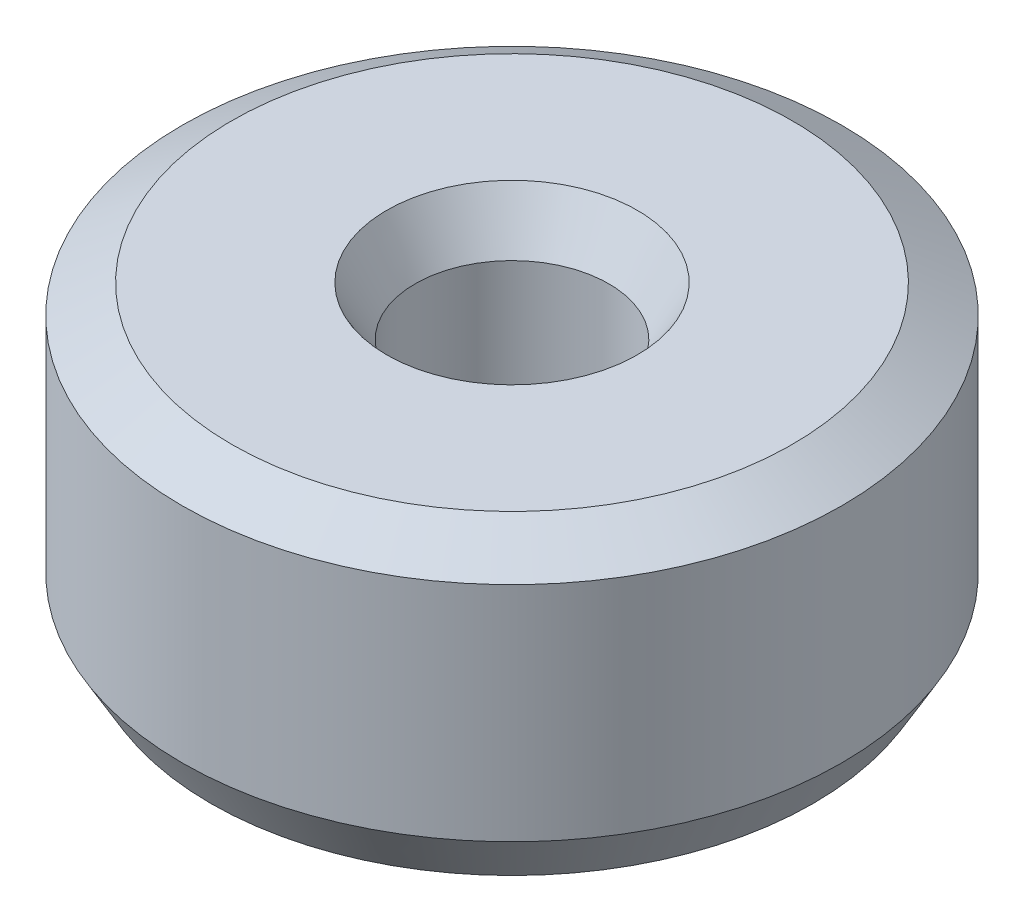
ISO-10303-21;
HEADER;
FILE_DESCRIPTION(('STEP AP214'),'2;1');
FILE_NAME('part.step','',(''),(''),'','','');
FILE_SCHEMA(('AUTOMOTIVE_DESIGN { 1 0 10303 214 1 1 1 1 }'));
ENDSEC;
DATA;
#1=APPLICATION_CONTEXT('core data for automotive mechanical design processes');
#2=APPLICATION_PROTOCOL_DEFINITION('international standard','automotive_design',2000,#1);
#3=PRODUCT_CONTEXT('',#1,'mechanical');
#4=PRODUCT('Part','Part','',(#3));
#5=PRODUCT_RELATED_PRODUCT_CATEGORY('part','',(#4));
#6=PRODUCT_DEFINITION_FORMATION('','',#4);
#7=PRODUCT_DEFINITION_CONTEXT('part definition',#1,'design');
#8=PRODUCT_DEFINITION('design','',#6,#7);
#9=PRODUCT_DEFINITION_SHAPE('','',#8);
#10=(LENGTH_UNIT() NAMED_UNIT(*) SI_UNIT(.MILLI.,.METRE.));
#11=(NAMED_UNIT(*) PLANE_ANGLE_UNIT() SI_UNIT($,.RADIAN.));
#12=(NAMED_UNIT(*) SI_UNIT($,.STERADIAN.) SOLID_ANGLE_UNIT());
#13=UNCERTAINTY_MEASURE_WITH_UNIT(LENGTH_MEASURE(1.E-05),#10,'distance_accuracy_value','');
#14=(GEOMETRIC_REPRESENTATION_CONTEXT(3) GLOBAL_UNCERTAINTY_ASSIGNED_CONTEXT((#13)) GLOBAL_UNIT_ASSIGNED_CONTEXT((#10,
#11,#12)) REPRESENTATION_CONTEXT('',''));
#15=CARTESIAN_POINT('',(0.,0.,0.));
#16=DIRECTION('',(0.,0.,1.));
#17=DIRECTION('',(1.,0.,0.));
#18=AXIS2_PLACEMENT_3D('',#15,#16,#17);
#19=CARTESIAN_POINT('',(0.,6.83697065104754,0.));
#20=DIRECTION('',(0.,-1.,0.));
#21=DIRECTION('',(0.,0.,-1.));
#22=AXIS2_PLACEMENT_3D('',#19,#20,#21);
#23=CYLINDRICAL_SURFACE('',#22,7.5);
#24=CARTESIAN_POINT('',(0.,1.12304000166108,0.));
#25=DIRECTION('',(0.,1.,0.));
#26=DIRECTION('',(0.,0.,1.));
#27=AXIS2_PLACEMENT_3D('',#24,#25,#26);
#28=CIRCLE('',#27,7.5);
#29=CARTESIAN_POINT('',(0.,1.12304000166108,7.5));
#30=VERTEX_POINT('',#29);
#31=EDGE_CURVE('E10',#30,#30,#28,.T.);
#32=ORIENTED_EDGE('',*,*,#31,.T.);
#33=EDGE_LOOP('',(#32));
#34=FACE_BOUND('',#33,.T.);
#35=CARTESIAN_POINT('',(0.,6.18858320377779,0.));
#36=DIRECTION('',(0.,1.,0.));
#37=DIRECTION('',(0.,0.,1.));
#38=AXIS2_PLACEMENT_3D('',#35,#36,#37);
#39=CIRCLE('',#38,7.5);
#40=CARTESIAN_POINT('',(0.,6.18858320377779,7.5));
#41=VERTEX_POINT('',#40);
#42=EDGE_CURVE('E50',#41,#41,#39,.F.);
#43=ORIENTED_EDGE('',*,*,#42,.T.);
#44=EDGE_LOOP('',(#43));
#45=FACE_BOUND('',#44,.T.);
#46=ADVANCED_FACE('F39',(#34,#45),#23,.T.);
#47=CARTESIAN_POINT('',(0.,6.83697065104754,0.));
#48=DIRECTION('',(0.,1.,0.));
#49=DIRECTION('',(0.,0.,1.));
#50=AXIS2_PLACEMENT_3D('',#47,#48,#49);
#51=PLANE('',#50);
#52=CARTESIAN_POINT('',(0.,6.83697065104754,0.));
#53=DIRECTION('',(0.,1.,0.));
#54=DIRECTION('',(0.,0.,1.));
#55=AXIS2_PLACEMENT_3D('',#52,#53,#54);
#56=CIRCLE('',#55,2.85029885530582);
#57=CARTESIAN_POINT('',(0.,6.83697065104754,2.85029885530582));
#58=VERTEX_POINT('',#57);
#59=EDGE_CURVE('E58',#58,#58,#56,.F.);
#60=ORIENTED_EDGE('',*,*,#59,.T.);
#61=EDGE_LOOP('',(#60));
#62=FACE_BOUND('',#61,.T.);
#63=CARTESIAN_POINT('',(0.,6.83697065104754,0.));
#64=DIRECTION('',(0.,1.,0.));
#65=DIRECTION('',(0.,0.,1.));
#66=AXIS2_PLACEMENT_3D('',#63,#64,#65);
#67=CIRCLE('',#66,6.37695999833892);
#68=CARTESIAN_POINT('',(0.,6.83697065104754,6.37695999833892));
#69=VERTEX_POINT('',#68);
#70=EDGE_CURVE('E61',#69,#69,#67,.T.);
#71=ORIENTED_EDGE('',*,*,#70,.T.);
#72=EDGE_LOOP('',(#71));
#73=FACE_BOUND('',#72,.T.);
#74=ADVANCED_FACE('F88',(#62,#73),#51,.T.);
#75=CARTESIAN_POINT('',(0.,0.,0.));
#76=DIRECTION('',(0.,1.,0.));
#77=DIRECTION('',(0.,0.,1.));
#78=AXIS2_PLACEMENT_3D('',#75,#76,#77);
#79=PLANE('',#78);
#80=CARTESIAN_POINT('',(0.,0.,0.));
#81=DIRECTION('',(0.,1.,0.));
#82=DIRECTION('',(0.,0.,1.));
#83=AXIS2_PLACEMENT_3D('',#80,#81,#82);
#84=CIRCLE('',#83,3.32495140969716);
#85=CARTESIAN_POINT('',(0.,0.,3.32495140969716));
#86=VERTEX_POINT('',#85);
#87=EDGE_CURVE('E51',#86,#86,#84,.T.);
#88=ORIENTED_EDGE('',*,*,#87,.T.);
#89=EDGE_LOOP('',(#88));
#90=FACE_BOUND('',#89,.T.);
#91=CARTESIAN_POINT('',(0.,0.,0.));
#92=DIRECTION('',(0.,1.,0.));
#93=DIRECTION('',(0.,0.,1.));
#94=AXIS2_PLACEMENT_3D('',#91,#92,#93);
#95=CIRCLE('',#94,6.85161255273025);
#96=CARTESIAN_POINT('',(0.,0.,6.85161255273025));
#97=VERTEX_POINT('',#96);
#98=EDGE_CURVE('E54',#97,#97,#95,.F.);
#99=ORIENTED_EDGE('',*,*,#98,.T.);
#100=EDGE_LOOP('',(#99));
#101=FACE_BOUND('',#100,.T.);
#102=ADVANCED_FACE('F83',(#90,#101),#79,.F.);
#103=CARTESIAN_POINT('',(0.,6.83697065104754,0.));
#104=DIRECTION('',(0.,-1.,0.));
#105=DIRECTION('',(0.,0.,-1.));
#106=AXIS2_PLACEMENT_3D('',#103,#104,#105);
#107=CYLINDRICAL_SURFACE('',#106,2.20191140803608);
#108=CARTESIAN_POINT('',(0.,5.71393064938647,0.));
#109=DIRECTION('',(0.,1.,0.));
#110=DIRECTION('',(0.,0.,1.));
#111=AXIS2_PLACEMENT_3D('',#108,#109,#110);
#112=CIRCLE('',#111,2.20191140803608);
#113=CARTESIAN_POINT('',(0.,5.71393064938647,2.20191140803608));
#114=VERTEX_POINT('',#113);
#115=EDGE_CURVE('E67',#114,#114,#112,.T.);
#116=ORIENTED_EDGE('',*,*,#115,.T.);
#117=EDGE_LOOP('',(#116));
#118=FACE_BOUND('',#117,.T.);
#119=CARTESIAN_POINT('',(0.,0.648387447269748,0.));
#120=DIRECTION('',(0.,1.,0.));
#121=DIRECTION('',(0.,0.,1.));
#122=AXIS2_PLACEMENT_3D('',#119,#120,#121);
#123=CIRCLE('',#122,2.20191140803608);
#124=CARTESIAN_POINT('',(0.,0.648387447269748,2.20191140803608));
#125=VERTEX_POINT('',#124);
#126=EDGE_CURVE('E69',#125,#125,#123,.F.);
#127=ORIENTED_EDGE('',*,*,#126,.T.);
#128=EDGE_LOOP('',(#127));
#129=FACE_BOUND('',#128,.T.);
#130=ADVANCED_FACE('F71',(#118,#129),#107,.F.);
#131=CARTESIAN_POINT('',(0.,5.71393064938647,0.));
#132=DIRECTION('',(0.,1.,0.));
#133=DIRECTION('',(0.,0.,1.));
#134=AXIS2_PLACEMENT_3D('',#131,#132,#133);
#135=CONICAL_SURFACE('',#134,2.20191140803608,0.523598775598302);
#136=ORIENTED_EDGE('',*,*,#59,.F.);
#137=EDGE_LOOP('',(#136));
#138=FACE_BOUND('',#137,.T.);
#139=ORIENTED_EDGE('',*,*,#115,.F.);
#140=EDGE_LOOP('',(#139));
#141=FACE_BOUND('',#140,.T.);
#142=ADVANCED_FACE('F77',(#138,#141),#135,.F.);
#143=CARTESIAN_POINT('',(0.,0.,0.));
#144=DIRECTION('',(0.,-1.,0.));
#145=DIRECTION('',(0.,0.,-1.));
#146=AXIS2_PLACEMENT_3D('',#143,#144,#145);
#147=CONICAL_SURFACE('',#146,3.32495140969716,1.04719755119659);
#148=ORIENTED_EDGE('',*,*,#126,.F.);
#149=EDGE_LOOP('',(#148));
#150=FACE_BOUND('',#149,.T.);
#151=ORIENTED_EDGE('',*,*,#87,.F.);
#152=EDGE_LOOP('',(#151));
#153=FACE_BOUND('',#152,.T.);
#154=ADVANCED_FACE('F73',(#150,#153),#147,.F.);
#155=CARTESIAN_POINT('',(0.,1.12304000166108,0.));
#156=DIRECTION('',(0.,1.,0.));
#157=DIRECTION('',(0.,0.,1.));
#158=AXIS2_PLACEMENT_3D('',#155,#156,#157);
#159=CONICAL_SURFACE('',#158,7.5,0.523598775598302);
#160=ORIENTED_EDGE('',*,*,#98,.F.);
#161=EDGE_LOOP('',(#160));
#162=FACE_BOUND('',#161,.T.);
#163=ORIENTED_EDGE('',*,*,#31,.F.);
#164=EDGE_LOOP('',(#163));
#165=FACE_BOUND('',#164,.T.);
#166=ADVANCED_FACE('F76',(#162,#165),#159,.T.);
#167=CARTESIAN_POINT('',(0.,6.83697065104754,0.));
#168=DIRECTION('',(0.,-1.,0.));
#169=DIRECTION('',(0.,0.,-1.));
#170=AXIS2_PLACEMENT_3D('',#167,#168,#169);
#171=CONICAL_SURFACE('',#170,6.37695999833892,1.04719755119659);
#172=ORIENTED_EDGE('',*,*,#42,.F.);
#173=EDGE_LOOP('',(#172));
#174=FACE_BOUND('',#173,.T.);
#175=ORIENTED_EDGE('',*,*,#70,.F.);
#176=EDGE_LOOP('',(#175));
#177=FACE_BOUND('',#176,.T.);
#178=ADVANCED_FACE('F45',(#174,#177),#171,.T.);
#179=CLOSED_SHELL('',(#46,#74,#102,#130,#142,#154,#166,#178));
#180=MANIFOLD_SOLID_BREP('B2',#179);
#181=ADVANCED_BREP_SHAPE_REPRESENTATION('',(#18,#180),#14);
#182=SHAPE_DEFINITION_REPRESENTATION(#9,#181);
ENDSEC;
END-ISO-10303-21;
